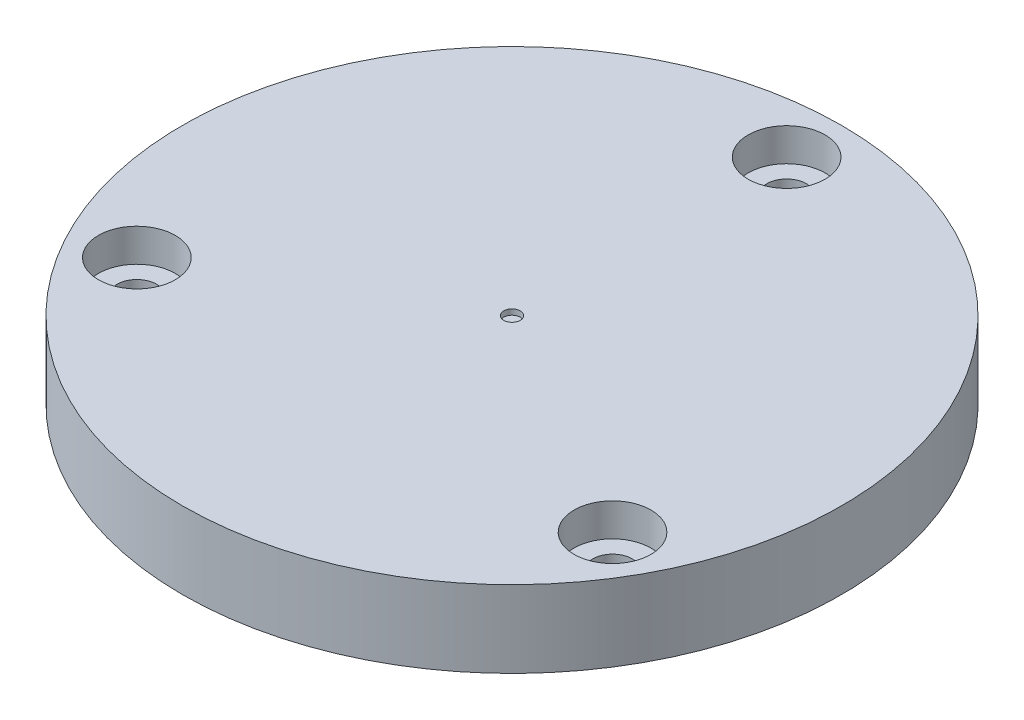
ISO-10303-21;
HEADER;
FILE_DESCRIPTION(('STEP AP214'),'2;1');
FILE_NAME('part.step','',(''),(''),'','','');
FILE_SCHEMA(('AUTOMOTIVE_DESIGN { 1 0 10303 214 1 1 1 1 }'));
ENDSEC;
DATA;
#1=APPLICATION_CONTEXT('core data for automotive mechanical design processes');
#2=APPLICATION_PROTOCOL_DEFINITION('international standard','automotive_design',2000,#1);
#3=PRODUCT_CONTEXT('',#1,'mechanical');
#4=PRODUCT('Part','Part','',(#3));
#5=PRODUCT_RELATED_PRODUCT_CATEGORY('part','',(#4));
#6=PRODUCT_DEFINITION_FORMATION('','',#4);
#7=PRODUCT_DEFINITION_CONTEXT('part definition',#1,'design');
#8=PRODUCT_DEFINITION('design','',#6,#7);
#9=PRODUCT_DEFINITION_SHAPE('','',#8);
#10=(LENGTH_UNIT() NAMED_UNIT(*) SI_UNIT(.MILLI.,.METRE.));
#11=(NAMED_UNIT(*) PLANE_ANGLE_UNIT() SI_UNIT($,.RADIAN.));
#12=(NAMED_UNIT(*) SI_UNIT($,.STERADIAN.) SOLID_ANGLE_UNIT());
#13=UNCERTAINTY_MEASURE_WITH_UNIT(LENGTH_MEASURE(1.E-05),#10,'distance_accuracy_value','');
#14=(GEOMETRIC_REPRESENTATION_CONTEXT(3) GLOBAL_UNCERTAINTY_ASSIGNED_CONTEXT((#13)) GLOBAL_UNIT_ASSIGNED_CONTEXT((#10,
#11,#12)) REPRESENTATION_CONTEXT('',''));
#15=CARTESIAN_POINT('',(0.,0.,0.));
#16=DIRECTION('',(0.,0.,1.));
#17=DIRECTION('',(1.,0.,0.));
#18=AXIS2_PLACEMENT_3D('',#15,#16,#17);
#19=CARTESIAN_POINT('',(0.,7.,-25.));
#20=DIRECTION('',(0.,-1.,0.));
#21=DIRECTION('',(0.,0.,-1.));
#22=AXIS2_PLACEMENT_3D('',#19,#20,#21);
#23=CYLINDRICAL_SURFACE('',#22,1.8);
#24=CARTESIAN_POINT('',(0.,0.,-25.));
#25=DIRECTION('',(0.,1.,0.));
#26=DIRECTION('',(0.,0.,1.));
#27=AXIS2_PLACEMENT_3D('',#24,#25,#26);
#28=CIRCLE('',#27,1.8);
#29=CARTESIAN_POINT('',(0.,0.,-23.2));
#30=VERTEX_POINT('',#29);
#31=EDGE_CURVE('E56',#30,#30,#28,.T.);
#32=ORIENTED_EDGE('',*,*,#31,.F.);
#33=EDGE_LOOP('',(#32));
#34=FACE_BOUND('',#33,.T.);
#35=CARTESIAN_POINT('',(0.,4.,-25.));
#36=DIRECTION('',(0.,1.,0.));
#37=DIRECTION('',(0.,0.,1.));
#38=AXIS2_PLACEMENT_3D('',#35,#36,#37);
#39=CIRCLE('',#38,1.8);
#40=CARTESIAN_POINT('',(0.,4.,-23.2));
#41=VERTEX_POINT('',#40);
#42=EDGE_CURVE('E45',#41,#41,#39,.T.);
#43=ORIENTED_EDGE('',*,*,#42,.T.);
#44=EDGE_LOOP('',(#43));
#45=FACE_BOUND('',#44,.T.);
#46=ADVANCED_FACE('F41',(#34,#45),#23,.F.);
#47=CARTESIAN_POINT('',(21.650635094611,7.,12.5));
#48=DIRECTION('',(0.,-1.,0.));
#49=DIRECTION('',(0.,0.,-1.));
#50=AXIS2_PLACEMENT_3D('',#47,#48,#49);
#51=CYLINDRICAL_SURFACE('',#50,1.8);
#52=CARTESIAN_POINT('',(21.650635094611,0.,12.5));
#53=DIRECTION('',(0.,1.,0.));
#54=DIRECTION('',(0.,0.,1.));
#55=AXIS2_PLACEMENT_3D('',#52,#53,#54);
#56=CIRCLE('',#55,1.8);
#57=CARTESIAN_POINT('',(21.650635094611,0.,14.3));
#58=VERTEX_POINT('',#57);
#59=EDGE_CURVE('E77',#58,#58,#56,.T.);
#60=ORIENTED_EDGE('',*,*,#59,.F.);
#61=EDGE_LOOP('',(#60));
#62=FACE_BOUND('',#61,.T.);
#63=CARTESIAN_POINT('',(21.650635094611,4.,12.5));
#64=DIRECTION('',(0.,1.,0.));
#65=DIRECTION('',(0.,0.,1.));
#66=AXIS2_PLACEMENT_3D('',#63,#64,#65);
#67=CIRCLE('',#66,1.8);
#68=CARTESIAN_POINT('',(21.650635094611,4.,14.3));
#69=VERTEX_POINT('',#68);
#70=EDGE_CURVE('E64',#69,#69,#67,.T.);
#71=ORIENTED_EDGE('',*,*,#70,.T.);
#72=EDGE_LOOP('',(#71));
#73=FACE_BOUND('',#72,.T.);
#74=ADVANCED_FACE('F153',(#62,#73),#51,.F.);
#75=CARTESIAN_POINT('',(-21.650635094611,7.,12.5));
#76=DIRECTION('',(0.,-1.,0.));
#77=DIRECTION('',(0.,0.,-1.));
#78=AXIS2_PLACEMENT_3D('',#75,#76,#77);
#79=CYLINDRICAL_SURFACE('',#78,1.8);
#80=CARTESIAN_POINT('',(-21.650635094611,0.,12.5));
#81=DIRECTION('',(0.,1.,0.));
#82=DIRECTION('',(0.,0.,1.));
#83=AXIS2_PLACEMENT_3D('',#80,#81,#82);
#84=CIRCLE('',#83,1.8);
#85=CARTESIAN_POINT('',(-21.650635094611,0.,14.3));
#86=VERTEX_POINT('',#85);
#87=EDGE_CURVE('E72',#86,#86,#84,.T.);
#88=ORIENTED_EDGE('',*,*,#87,.F.);
#89=EDGE_LOOP('',(#88));
#90=FACE_BOUND('',#89,.T.);
#91=CARTESIAN_POINT('',(-21.650635094611,4.,12.5));
#92=DIRECTION('',(0.,1.,0.));
#93=DIRECTION('',(0.,0.,1.));
#94=AXIS2_PLACEMENT_3D('',#91,#92,#93);
#95=CIRCLE('',#94,1.8);
#96=CARTESIAN_POINT('',(-21.650635094611,4.,14.3));
#97=VERTEX_POINT('',#96);
#98=EDGE_CURVE('E61',#97,#97,#95,.T.);
#99=ORIENTED_EDGE('',*,*,#98,.T.);
#100=EDGE_LOOP('',(#99));
#101=FACE_BOUND('',#100,.T.);
#102=ADVANCED_FACE('F129',(#90,#101),#79,.F.);
#103=CARTESIAN_POINT('',(0.,7.,0.));
#104=DIRECTION('',(0.,1.,0.));
#105=DIRECTION('',(0.,0.,1.));
#106=AXIS2_PLACEMENT_3D('',#103,#104,#105);
#107=PLANE('',#106);
#108=CARTESIAN_POINT('',(0.,7.,0.));
#109=DIRECTION('',(0.,1.,0.));
#110=DIRECTION('',(0.,0.,1.));
#111=AXIS2_PLACEMENT_3D('',#108,#109,#110);
#112=CIRCLE('',#111,0.75);
#113=CARTESIAN_POINT('',(0.,7.,0.75));
#114=VERTEX_POINT('',#113);
#115=EDGE_CURVE('E108',#114,#114,#112,.T.);
#116=ORIENTED_EDGE('',*,*,#115,.F.);
#117=EDGE_LOOP('',(#116));
#118=FACE_BOUND('',#117,.T.);
#119=CARTESIAN_POINT('',(0.,7.,-25.));
#120=DIRECTION('',(0.,1.,0.));
#121=DIRECTION('',(0.,0.,1.));
#122=AXIS2_PLACEMENT_3D('',#119,#120,#121);
#123=CIRCLE('',#122,3.5);
#124=CARTESIAN_POINT('',(0.,7.,-21.5));
#125=VERTEX_POINT('',#124);
#126=EDGE_CURVE('E101',#125,#125,#123,.T.);
#127=ORIENTED_EDGE('',*,*,#126,.F.);
#128=EDGE_LOOP('',(#127));
#129=FACE_BOUND('',#128,.T.);
#130=CARTESIAN_POINT('',(21.650635094611,7.,12.5));
#131=DIRECTION('',(0.,1.,0.));
#132=DIRECTION('',(0.,0.,1.));
#133=AXIS2_PLACEMENT_3D('',#130,#131,#132);
#134=CIRCLE('',#133,3.5);
#135=CARTESIAN_POINT('',(21.650635094611,7.,16.));
#136=VERTEX_POINT('',#135);
#137=EDGE_CURVE('E97',#136,#136,#134,.T.);
#138=ORIENTED_EDGE('',*,*,#137,.F.);
#139=EDGE_LOOP('',(#138));
#140=FACE_BOUND('',#139,.T.);
#141=CARTESIAN_POINT('',(-21.650635094611,7.,12.5));
#142=DIRECTION('',(0.,1.,0.));
#143=DIRECTION('',(0.,0.,1.));
#144=AXIS2_PLACEMENT_3D('',#141,#142,#143);
#145=CIRCLE('',#144,3.5);
#146=CARTESIAN_POINT('',(-21.650635094611,7.,16.));
#147=VERTEX_POINT('',#146);
#148=EDGE_CURVE('E88',#147,#147,#145,.T.);
#149=ORIENTED_EDGE('',*,*,#148,.F.);
#150=EDGE_LOOP('',(#149));
#151=FACE_BOUND('',#150,.T.);
#152=CARTESIAN_POINT('',(0.,7.,0.));
#153=DIRECTION('',(0.,1.,0.));
#154=DIRECTION('',(0.,0.,1.));
#155=AXIS2_PLACEMENT_3D('',#152,#153,#154);
#156=CIRCLE('',#155,30.);
#157=CARTESIAN_POINT('',(0.,7.,30.));
#158=VERTEX_POINT('',#157);
#159=EDGE_CURVE('E10',#158,#158,#156,.T.);
#160=ORIENTED_EDGE('',*,*,#159,.T.);
#161=EDGE_LOOP('',(#160));
#162=FACE_BOUND('',#161,.T.);
#163=ADVANCED_FACE('F125',(#118,#129,#140,#151,#162),#107,.T.);
#164=CARTESIAN_POINT('',(0.,0.,0.));
#165=DIRECTION('',(0.,1.,0.));
#166=DIRECTION('',(0.,0.,1.));
#167=AXIS2_PLACEMENT_3D('',#164,#165,#166);
#168=PLANE('',#167);
#169=CARTESIAN_POINT('',(0.,0.,0.));
#170=DIRECTION('',(0.,1.,0.));
#171=DIRECTION('',(0.,0.,1.));
#172=AXIS2_PLACEMENT_3D('',#169,#170,#171);
#173=CIRCLE('',#172,30.);
#174=CARTESIAN_POINT('',(0.,0.,30.));
#175=VERTEX_POINT('',#174);
#176=EDGE_CURVE('E50',#175,#175,#173,.T.);
#177=ORIENTED_EDGE('',*,*,#176,.F.);
#178=EDGE_LOOP('',(#177));
#179=FACE_BOUND('',#178,.T.);
#180=ORIENTED_EDGE('',*,*,#31,.T.);
#181=EDGE_LOOP('',(#180));
#182=FACE_BOUND('',#181,.T.);
#183=ORIENTED_EDGE('',*,*,#59,.T.);
#184=EDGE_LOOP('',(#183));
#185=FACE_BOUND('',#184,.T.);
#186=ORIENTED_EDGE('',*,*,#87,.T.);
#187=EDGE_LOOP('',(#186));
#188=FACE_BOUND('',#187,.T.);
#189=ADVANCED_FACE('F128',(#179,#182,#185,#188),#168,.F.);
#190=CARTESIAN_POINT('',(0.,7.,0.));
#191=DIRECTION('',(0.,-1.,0.));
#192=DIRECTION('',(0.,0.,-1.));
#193=AXIS2_PLACEMENT_3D('',#190,#191,#192);
#194=CYLINDRICAL_SURFACE('',#193,30.);
#195=ORIENTED_EDGE('',*,*,#159,.F.);
#196=EDGE_LOOP('',(#195));
#197=FACE_BOUND('',#196,.T.);
#198=ORIENTED_EDGE('',*,*,#176,.T.);
#199=EDGE_LOOP('',(#198));
#200=FACE_BOUND('',#199,.T.);
#201=ADVANCED_FACE('F43',(#197,#200),#194,.T.);
#202=CARTESIAN_POINT('',(-21.650635094611,4.,12.5));
#203=DIRECTION('',(0.,1.,0.));
#204=DIRECTION('',(0.,0.,1.));
#205=AXIS2_PLACEMENT_3D('',#202,#203,#204);
#206=CYLINDRICAL_SURFACE('',#205,3.5);
#207=CARTESIAN_POINT('',(-21.650635094611,4.,12.5));
#208=DIRECTION('',(0.,1.,0.));
#209=DIRECTION('',(0.,0.,1.));
#210=AXIS2_PLACEMENT_3D('',#207,#208,#209);
#211=CIRCLE('',#210,3.5);
#212=CARTESIAN_POINT('',(-21.650635094611,4.,16.));
#213=VERTEX_POINT('',#212);
#214=EDGE_CURVE('E84',#213,#213,#211,.T.);
#215=ORIENTED_EDGE('',*,*,#214,.F.);
#216=EDGE_LOOP('',(#215));
#217=FACE_BOUND('',#216,.T.);
#218=ORIENTED_EDGE('',*,*,#148,.T.);
#219=EDGE_LOOP('',(#218));
#220=FACE_BOUND('',#219,.T.);
#221=ADVANCED_FACE('F137',(#217,#220),#206,.F.);
#222=CARTESIAN_POINT('',(-21.650635094611,4.,12.5));
#223=DIRECTION('',(0.,1.,0.));
#224=DIRECTION('',(0.,0.,1.));
#225=AXIS2_PLACEMENT_3D('',#222,#223,#224);
#226=PLANE('',#225);
#227=ORIENTED_EDGE('',*,*,#98,.F.);
#228=EDGE_LOOP('',(#227));
#229=FACE_BOUND('',#228,.T.);
#230=ORIENTED_EDGE('',*,*,#214,.T.);
#231=EDGE_LOOP('',(#230));
#232=FACE_BOUND('',#231,.T.);
#233=ADVANCED_FACE('F139',(#229,#232),#226,.T.);
#234=CARTESIAN_POINT('',(21.650635094611,4.,12.5));
#235=DIRECTION('',(0.,1.,0.));
#236=DIRECTION('',(0.,0.,1.));
#237=AXIS2_PLACEMENT_3D('',#234,#235,#236);
#238=CYLINDRICAL_SURFACE('',#237,3.5);
#239=CARTESIAN_POINT('',(21.650635094611,4.,12.5));
#240=DIRECTION('',(0.,1.,0.));
#241=DIRECTION('',(0.,0.,1.));
#242=AXIS2_PLACEMENT_3D('',#239,#240,#241);
#243=CIRCLE('',#242,3.5);
#244=CARTESIAN_POINT('',(21.650635094611,4.,16.));
#245=VERTEX_POINT('',#244);
#246=EDGE_CURVE('E93',#245,#245,#243,.T.);
#247=ORIENTED_EDGE('',*,*,#246,.F.);
#248=EDGE_LOOP('',(#247));
#249=FACE_BOUND('',#248,.T.);
#250=ORIENTED_EDGE('',*,*,#137,.T.);
#251=EDGE_LOOP('',(#250));
#252=FACE_BOUND('',#251,.T.);
#253=ADVANCED_FACE('F146',(#249,#252),#238,.F.);
#254=CARTESIAN_POINT('',(21.650635094611,4.,12.5));
#255=DIRECTION('',(0.,1.,0.));
#256=DIRECTION('',(0.,0.,1.));
#257=AXIS2_PLACEMENT_3D('',#254,#255,#256);
#258=PLANE('',#257);
#259=ORIENTED_EDGE('',*,*,#70,.F.);
#260=EDGE_LOOP('',(#259));
#261=FACE_BOUND('',#260,.T.);
#262=ORIENTED_EDGE('',*,*,#246,.T.);
#263=EDGE_LOOP('',(#262));
#264=FACE_BOUND('',#263,.T.);
#265=ADVANCED_FACE('F220',(#261,#264),#258,.T.);
#266=CARTESIAN_POINT('',(0.,4.,-25.));
#267=DIRECTION('',(0.,1.,0.));
#268=DIRECTION('',(0.,0.,1.));
#269=AXIS2_PLACEMENT_3D('',#266,#267,#268);
#270=CYLINDRICAL_SURFACE('',#269,3.5);
#271=CARTESIAN_POINT('',(0.,4.,-25.));
#272=DIRECTION('',(0.,1.,0.));
#273=DIRECTION('',(0.,0.,1.));
#274=AXIS2_PLACEMENT_3D('',#271,#272,#273);
#275=CIRCLE('',#274,3.5);
#276=CARTESIAN_POINT('',(0.,4.,-21.5));
#277=VERTEX_POINT('',#276);
#278=EDGE_CURVE('E65',#277,#277,#275,.T.);
#279=ORIENTED_EDGE('',*,*,#278,.F.);
#280=EDGE_LOOP('',(#279));
#281=FACE_BOUND('',#280,.T.);
#282=ORIENTED_EDGE('',*,*,#126,.T.);
#283=EDGE_LOOP('',(#282));
#284=FACE_BOUND('',#283,.T.);
#285=ADVANCED_FACE('F231',(#281,#284),#270,.F.);
#286=CARTESIAN_POINT('',(0.,4.,-25.));
#287=DIRECTION('',(0.,1.,0.));
#288=DIRECTION('',(0.,0.,1.));
#289=AXIS2_PLACEMENT_3D('',#286,#287,#288);
#290=PLANE('',#289);
#291=ORIENTED_EDGE('',*,*,#42,.F.);
#292=EDGE_LOOP('',(#291));
#293=FACE_BOUND('',#292,.T.);
#294=ORIENTED_EDGE('',*,*,#278,.T.);
#295=EDGE_LOOP('',(#294));
#296=FACE_BOUND('',#295,.T.);
#297=ADVANCED_FACE('F121',(#293,#296),#290,.T.);
#298=CARTESIAN_POINT('',(0.,6.5,0.));
#299=DIRECTION('',(0.,1.,0.));
#300=DIRECTION('',(0.,0.,1.));
#301=AXIS2_PLACEMENT_3D('',#298,#299,#300);
#302=CYLINDRICAL_SURFACE('',#301,0.75);
#303=CARTESIAN_POINT('',(0.,6.5,0.));
#304=DIRECTION('',(0.,1.,0.));
#305=DIRECTION('',(0.,0.,1.));
#306=AXIS2_PLACEMENT_3D('',#303,#304,#305);
#307=CIRCLE('',#306,0.75);
#308=CARTESIAN_POINT('',(0.,6.5,0.75));
#309=VERTEX_POINT('',#308);
#310=EDGE_CURVE('E89',#309,#309,#307,.T.);
#311=ORIENTED_EDGE('',*,*,#310,.F.);
#312=EDGE_LOOP('',(#311));
#313=FACE_BOUND('',#312,.T.);
#314=ORIENTED_EDGE('',*,*,#115,.T.);
#315=EDGE_LOOP('',(#314));
#316=FACE_BOUND('',#315,.T.);
#317=ADVANCED_FACE('F118',(#313,#316),#302,.F.);
#318=CARTESIAN_POINT('',(0.,6.5,0.));
#319=DIRECTION('',(0.,1.,0.));
#320=DIRECTION('',(0.,0.,1.));
#321=AXIS2_PLACEMENT_3D('',#318,#319,#320);
#322=PLANE('',#321);
#323=ORIENTED_EDGE('',*,*,#310,.T.);
#324=EDGE_LOOP('',(#323));
#325=FACE_BOUND('',#324,.T.);
#326=ADVANCED_FACE('F116',(#325),#322,.T.);
#327=CLOSED_SHELL('',(#46,#74,#102,#163,#189,#201,#221,#233,#253,#265,#285,#297,#317,#326));
#328=MANIFOLD_SOLID_BREP('B2',#327);
#329=ADVANCED_BREP_SHAPE_REPRESENTATION('',(#18,#328),#14);
#330=SHAPE_DEFINITION_REPRESENTATION(#9,#329);
ENDSEC;
END-ISO-10303-21;
